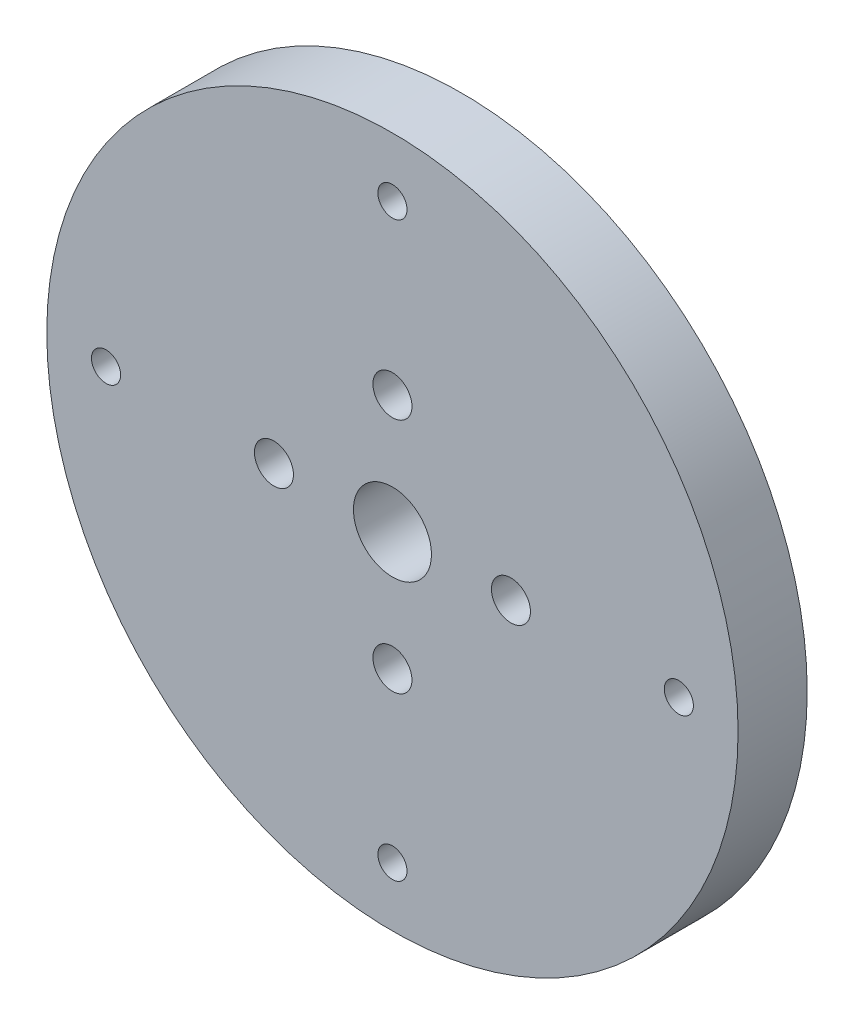
ISO-10303-21;
HEADER;
FILE_DESCRIPTION(('STEP AP214'),'2;1');
FILE_NAME('part.step','',(''),(''),'','','');
FILE_SCHEMA(('AUTOMOTIVE_DESIGN { 1 0 10303 214 1 1 1 1 }'));
ENDSEC;
DATA;
#1=APPLICATION_CONTEXT('core data for automotive mechanical design processes');
#2=APPLICATION_PROTOCOL_DEFINITION('international standard','automotive_design',2000,#1);
#3=PRODUCT_CONTEXT('',#1,'mechanical');
#4=PRODUCT('Part','Part','',(#3));
#5=PRODUCT_RELATED_PRODUCT_CATEGORY('part','',(#4));
#6=PRODUCT_DEFINITION_FORMATION('','',#4);
#7=PRODUCT_DEFINITION_CONTEXT('part definition',#1,'design');
#8=PRODUCT_DEFINITION('design','',#6,#7);
#9=PRODUCT_DEFINITION_SHAPE('','',#8);
#10=(LENGTH_UNIT() NAMED_UNIT(*) SI_UNIT(.MILLI.,.METRE.));
#11=(NAMED_UNIT(*) PLANE_ANGLE_UNIT() SI_UNIT($,.RADIAN.));
#12=(NAMED_UNIT(*) SI_UNIT($,.STERADIAN.) SOLID_ANGLE_UNIT());
#13=UNCERTAINTY_MEASURE_WITH_UNIT(LENGTH_MEASURE(1.E-05),#10,'distance_accuracy_value','');
#14=(GEOMETRIC_REPRESENTATION_CONTEXT(3) GLOBAL_UNCERTAINTY_ASSIGNED_CONTEXT((#13)) GLOBAL_UNIT_ASSIGNED_CONTEXT((#10,
#11,#12)) REPRESENTATION_CONTEXT('',''));
#15=CARTESIAN_POINT('',(0.,0.,0.));
#16=DIRECTION('',(0.,0.,1.));
#17=DIRECTION('',(1.,0.,0.));
#18=AXIS2_PLACEMENT_3D('',#15,#16,#17);
#19=CARTESIAN_POINT('',(29.0000000000008,8.18902359905425E-13,7.));
#20=DIRECTION('',(0.,0.,-1.));
#21=DIRECTION('',(-1.,0.,0.));
#22=AXIS2_PLACEMENT_3D('',#19,#20,#21);
#23=CYLINDRICAL_SURFACE('',#22,1.47500000000064);
#24=CARTESIAN_POINT('',(29.0000000000008,8.18902359905425E-13,7.));
#25=DIRECTION('',(0.,0.,1.));
#26=DIRECTION('',(1.,0.,0.));
#27=AXIS2_PLACEMENT_3D('',#24,#25,#26);
#28=CIRCLE('',#27,1.47500000000064);
#29=CARTESIAN_POINT('',(30.4750000000015,8.18902359905425E-13,7.));
#30=VERTEX_POINT('',#29);
#31=EDGE_CURVE('E40',#30,#30,#28,.T.);
#32=ORIENTED_EDGE('',*,*,#31,.T.);
#33=EDGE_LOOP('',(#32));
#34=FACE_BOUND('',#33,.T.);
#35=CARTESIAN_POINT('',(29.0000000000008,8.18902359905425E-13,0.));
#36=DIRECTION('',(0.,0.,1.));
#37=DIRECTION('',(1.,0.,0.));
#38=AXIS2_PLACEMENT_3D('',#35,#36,#37);
#39=CIRCLE('',#38,1.47500000000064);
#40=CARTESIAN_POINT('',(30.4750000000015,8.18902359905425E-13,0.));
#41=VERTEX_POINT('',#40);
#42=EDGE_CURVE('E72',#41,#41,#39,.T.);
#43=ORIENTED_EDGE('',*,*,#42,.F.);
#44=EDGE_LOOP('',(#43));
#45=FACE_BOUND('',#44,.T.);
#46=ADVANCED_FACE('F32',(#34,#45),#23,.F.);
#47=CARTESIAN_POINT('',(1.63780471981085E-12,-29.,7.));
#48=DIRECTION('',(0.,0.,-1.));
#49=DIRECTION('',(-1.,0.,0.));
#50=AXIS2_PLACEMENT_3D('',#47,#48,#49);
#51=CYLINDRICAL_SURFACE('',#50,1.47500000000176);
#52=CARTESIAN_POINT('',(1.63780471981085E-12,-29.,7.));
#53=DIRECTION('',(0.,0.,1.));
#54=DIRECTION('',(1.,0.,0.));
#55=AXIS2_PLACEMENT_3D('',#52,#53,#54);
#56=CIRCLE('',#55,1.47500000000176);
#57=CARTESIAN_POINT('',(1.4750000000034,-29.,7.));
#58=VERTEX_POINT('',#57);
#59=EDGE_CURVE('E45',#58,#58,#56,.T.);
#60=ORIENTED_EDGE('',*,*,#59,.T.);
#61=EDGE_LOOP('',(#60));
#62=FACE_BOUND('',#61,.T.);
#63=CARTESIAN_POINT('',(1.63780471981085E-12,-29.,0.));
#64=DIRECTION('',(0.,0.,1.));
#65=DIRECTION('',(1.,0.,0.));
#66=AXIS2_PLACEMENT_3D('',#63,#64,#65);
#67=CIRCLE('',#66,1.47500000000176);
#68=CARTESIAN_POINT('',(1.4750000000034,-29.,0.));
#69=VERTEX_POINT('',#68);
#70=EDGE_CURVE('E70',#69,#69,#67,.T.);
#71=ORIENTED_EDGE('',*,*,#70,.F.);
#72=EDGE_LOOP('',(#71));
#73=FACE_BOUND('',#72,.T.);
#74=ADVANCED_FACE('F105',(#62,#73),#51,.F.);
#75=CARTESIAN_POINT('',(-28.9999999999992,-8.22453835622952E-13,7.));
#76=DIRECTION('',(0.,0.,-1.));
#77=DIRECTION('',(-1.,0.,0.));
#78=AXIS2_PLACEMENT_3D('',#75,#76,#77);
#79=CYLINDRICAL_SURFACE('',#78,1.47500000000132);
#80=CARTESIAN_POINT('',(-28.9999999999992,-8.22453835622952E-13,7.));
#81=DIRECTION('',(0.,0.,1.));
#82=DIRECTION('',(1.,0.,0.));
#83=AXIS2_PLACEMENT_3D('',#80,#81,#82);
#84=CIRCLE('',#83,1.47500000000132);
#85=CARTESIAN_POINT('',(-27.5249999999979,-8.22453835622952E-13,7.));
#86=VERTEX_POINT('',#85);
#87=EDGE_CURVE('E100',#86,#86,#84,.T.);
#88=ORIENTED_EDGE('',*,*,#87,.T.);
#89=EDGE_LOOP('',(#88));
#90=FACE_BOUND('',#89,.T.);
#91=CARTESIAN_POINT('',(-28.9999999999992,-8.22453835622952E-13,0.));
#92=DIRECTION('',(0.,0.,1.));
#93=DIRECTION('',(1.,0.,0.));
#94=AXIS2_PLACEMENT_3D('',#91,#92,#93);
#95=CIRCLE('',#94,1.47500000000132);
#96=CARTESIAN_POINT('',(-27.5249999999979,-8.22453835622952E-13,0.));
#97=VERTEX_POINT('',#96);
#98=EDGE_CURVE('E67',#97,#97,#95,.T.);
#99=ORIENTED_EDGE('',*,*,#98,.F.);
#100=EDGE_LOOP('',(#99));
#101=FACE_BOUND('',#100,.T.);
#102=ADVANCED_FACE('F124',(#90,#101),#79,.F.);
#103=CARTESIAN_POINT('',(12.0000000000011,1.1488748676929E-12,7.));
#104=DIRECTION('',(0.,0.,-1.));
#105=DIRECTION('',(-1.,0.,0.));
#106=AXIS2_PLACEMENT_3D('',#103,#104,#105);
#107=CYLINDRICAL_SURFACE('',#106,1.9750000000008);
#108=CARTESIAN_POINT('',(12.0000000000011,1.1488748676929E-12,7.));
#109=DIRECTION('',(0.,0.,1.));
#110=DIRECTION('',(1.,0.,0.));
#111=AXIS2_PLACEMENT_3D('',#108,#109,#110);
#112=CIRCLE('',#111,1.9750000000008);
#113=CARTESIAN_POINT('',(13.975000000002,1.1488748676929E-12,7.));
#114=VERTEX_POINT('',#113);
#115=EDGE_CURVE('E97',#114,#114,#112,.T.);
#116=ORIENTED_EDGE('',*,*,#115,.T.);
#117=EDGE_LOOP('',(#116));
#118=FACE_BOUND('',#117,.T.);
#119=CARTESIAN_POINT('',(12.0000000000011,1.1488748676929E-12,0.));
#120=DIRECTION('',(0.,0.,1.));
#121=DIRECTION('',(1.,0.,0.));
#122=AXIS2_PLACEMENT_3D('',#119,#120,#121);
#123=CIRCLE('',#122,1.9750000000008);
#124=CARTESIAN_POINT('',(13.975000000002,1.1488748676929E-12,0.));
#125=VERTEX_POINT('',#124);
#126=EDGE_CURVE('E64',#125,#125,#123,.T.);
#127=ORIENTED_EDGE('',*,*,#126,.F.);
#128=EDGE_LOOP('',(#127));
#129=FACE_BOUND('',#128,.T.);
#130=ADVANCED_FACE('F131',(#118,#129),#107,.F.);
#131=CARTESIAN_POINT('',(2.29774973538579E-12,-12.,7.));
#132=DIRECTION('',(0.,0.,-1.));
#133=DIRECTION('',(-1.,0.,0.));
#134=AXIS2_PLACEMENT_3D('',#131,#132,#133);
#135=CYLINDRICAL_SURFACE('',#134,1.97500000000228);
#136=CARTESIAN_POINT('',(2.29774973538579E-12,-12.,7.));
#137=DIRECTION('',(0.,0.,1.));
#138=DIRECTION('',(1.,0.,0.));
#139=AXIS2_PLACEMENT_3D('',#136,#137,#138);
#140=CIRCLE('',#139,1.97500000000228);
#141=CARTESIAN_POINT('',(1.97500000000458,-12.,7.));
#142=VERTEX_POINT('',#141);
#143=EDGE_CURVE('E94',#142,#142,#140,.T.);
#144=ORIENTED_EDGE('',*,*,#143,.T.);
#145=EDGE_LOOP('',(#144));
#146=FACE_BOUND('',#145,.T.);
#147=CARTESIAN_POINT('',(2.29774973538579E-12,-12.,0.));
#148=DIRECTION('',(0.,0.,1.));
#149=DIRECTION('',(1.,0.,0.));
#150=AXIS2_PLACEMENT_3D('',#147,#148,#149);
#151=CIRCLE('',#150,1.97500000000228);
#152=CARTESIAN_POINT('',(1.97500000000458,-12.,0.));
#153=VERTEX_POINT('',#152);
#154=EDGE_CURVE('E61',#153,#153,#151,.T.);
#155=ORIENTED_EDGE('',*,*,#154,.F.);
#156=EDGE_LOOP('',(#155));
#157=FACE_BOUND('',#156,.T.);
#158=ADVANCED_FACE('F135',(#146,#157),#135,.F.);
#159=CARTESIAN_POINT('',(-11.9999999999989,-1.15034444385187E-12,7.));
#160=DIRECTION('',(0.,0.,-1.));
#161=DIRECTION('',(-1.,0.,0.));
#162=AXIS2_PLACEMENT_3D('',#159,#160,#161);
#163=CYLINDRICAL_SURFACE('',#162,1.97500000000156);
#164=CARTESIAN_POINT('',(-11.9999999999989,-1.15034444385187E-12,7.));
#165=DIRECTION('',(0.,0.,1.));
#166=DIRECTION('',(1.,0.,0.));
#167=AXIS2_PLACEMENT_3D('',#164,#165,#166);
#168=CIRCLE('',#167,1.97500000000156);
#169=CARTESIAN_POINT('',(-10.0249999999973,-1.15034444385187E-12,7.));
#170=VERTEX_POINT('',#169);
#171=EDGE_CURVE('E91',#170,#170,#168,.T.);
#172=ORIENTED_EDGE('',*,*,#171,.T.);
#173=EDGE_LOOP('',(#172));
#174=FACE_BOUND('',#173,.T.);
#175=CARTESIAN_POINT('',(-11.9999999999989,-1.15034444385187E-12,0.));
#176=DIRECTION('',(0.,0.,1.));
#177=DIRECTION('',(1.,0.,0.));
#178=AXIS2_PLACEMENT_3D('',#175,#176,#177);
#179=CIRCLE('',#178,1.97500000000156);
#180=CARTESIAN_POINT('',(-10.0249999999973,-1.15034444385187E-12,0.));
#181=VERTEX_POINT('',#180);
#182=EDGE_CURVE('E58',#181,#181,#179,.T.);
#183=ORIENTED_EDGE('',*,*,#182,.F.);
#184=EDGE_LOOP('',(#183));
#185=FACE_BOUND('',#184,.T.);
#186=ADVANCED_FACE('F139',(#174,#185),#163,.F.);
#187=CARTESIAN_POINT('',(0.,0.,7.));
#188=DIRECTION('',(0.,0.,-1.));
#189=DIRECTION('',(-1.,0.,0.));
#190=AXIS2_PLACEMENT_3D('',#187,#188,#189);
#191=CYLINDRICAL_SURFACE('',#190,35.);
#192=CARTESIAN_POINT('',(0.,0.,7.));
#193=DIRECTION('',(0.,0.,1.));
#194=DIRECTION('',(1.,0.,0.));
#195=AXIS2_PLACEMENT_3D('',#192,#193,#194);
#196=CIRCLE('',#195,35.);
#197=CARTESIAN_POINT('',(35.,0.,7.));
#198=VERTEX_POINT('',#197);
#199=EDGE_CURVE('E86',#198,#198,#196,.T.);
#200=ORIENTED_EDGE('',*,*,#199,.F.);
#201=EDGE_LOOP('',(#200));
#202=FACE_BOUND('',#201,.T.);
#203=CARTESIAN_POINT('',(0.,0.,0.));
#204=DIRECTION('',(0.,0.,1.));
#205=DIRECTION('',(1.,0.,0.));
#206=AXIS2_PLACEMENT_3D('',#203,#204,#205);
#207=CIRCLE('',#206,35.);
#208=CARTESIAN_POINT('',(35.,0.,0.));
#209=VERTEX_POINT('',#208);
#210=EDGE_CURVE('E55',#209,#209,#207,.T.);
#211=ORIENTED_EDGE('',*,*,#210,.T.);
#212=EDGE_LOOP('',(#211));
#213=FACE_BOUND('',#212,.T.);
#214=ADVANCED_FACE('F143',(#202,#213),#191,.T.);
#215=CARTESIAN_POINT('',(0.,29.,7.));
#216=DIRECTION('',(0.,0.,-1.));
#217=DIRECTION('',(-1.,0.,0.));
#218=AXIS2_PLACEMENT_3D('',#215,#216,#217);
#219=CYLINDRICAL_SURFACE('',#218,1.475);
#220=CARTESIAN_POINT('',(0.,29.,7.));
#221=DIRECTION('',(0.,0.,1.));
#222=DIRECTION('',(1.,0.,0.));
#223=AXIS2_PLACEMENT_3D('',#220,#221,#222);
#224=CIRCLE('',#223,1.475);
#225=CARTESIAN_POINT('',(1.475,29.,7.));
#226=VERTEX_POINT('',#225);
#227=EDGE_CURVE('E81',#226,#226,#224,.T.);
#228=ORIENTED_EDGE('',*,*,#227,.T.);
#229=EDGE_LOOP('',(#228));
#230=FACE_BOUND('',#229,.T.);
#231=CARTESIAN_POINT('',(0.,29.,0.));
#232=DIRECTION('',(0.,0.,1.));
#233=DIRECTION('',(1.,0.,0.));
#234=AXIS2_PLACEMENT_3D('',#231,#232,#233);
#235=CIRCLE('',#234,1.475);
#236=CARTESIAN_POINT('',(1.475,29.,0.));
#237=VERTEX_POINT('',#236);
#238=EDGE_CURVE('E52',#237,#237,#235,.T.);
#239=ORIENTED_EDGE('',*,*,#238,.F.);
#240=EDGE_LOOP('',(#239));
#241=FACE_BOUND('',#240,.T.);
#242=ADVANCED_FACE('F146',(#230,#241),#219,.F.);
#243=CARTESIAN_POINT('',(0.,12.,7.));
#244=DIRECTION('',(0.,0.,-1.));
#245=DIRECTION('',(-1.,0.,0.));
#246=AXIS2_PLACEMENT_3D('',#243,#244,#245);
#247=CYLINDRICAL_SURFACE('',#246,1.975);
#248=CARTESIAN_POINT('',(0.,12.,7.));
#249=DIRECTION('',(0.,0.,1.));
#250=DIRECTION('',(1.,0.,0.));
#251=AXIS2_PLACEMENT_3D('',#248,#249,#250);
#252=CIRCLE('',#251,1.975);
#253=CARTESIAN_POINT('',(1.975,12.,7.));
#254=VERTEX_POINT('',#253);
#255=EDGE_CURVE('E77',#254,#254,#252,.T.);
#256=ORIENTED_EDGE('',*,*,#255,.T.);
#257=EDGE_LOOP('',(#256));
#258=FACE_BOUND('',#257,.T.);
#259=CARTESIAN_POINT('',(0.,12.,0.));
#260=DIRECTION('',(0.,0.,1.));
#261=DIRECTION('',(1.,0.,0.));
#262=AXIS2_PLACEMENT_3D('',#259,#260,#261);
#263=CIRCLE('',#262,1.975);
#264=CARTESIAN_POINT('',(1.975,12.,0.));
#265=VERTEX_POINT('',#264);
#266=EDGE_CURVE('E49',#265,#265,#263,.T.);
#267=ORIENTED_EDGE('',*,*,#266,.F.);
#268=EDGE_LOOP('',(#267));
#269=FACE_BOUND('',#268,.T.);
#270=ADVANCED_FACE('F34',(#258,#269),#247,.F.);
#271=CARTESIAN_POINT('',(0.,0.,7.));
#272=DIRECTION('',(0.,0.,-1.));
#273=DIRECTION('',(-1.,0.,0.));
#274=AXIS2_PLACEMENT_3D('',#271,#272,#273);
#275=CYLINDRICAL_SURFACE('',#274,3.95);
#276=CARTESIAN_POINT('',(0.,0.,7.));
#277=DIRECTION('',(0.,0.,1.));
#278=DIRECTION('',(1.,0.,0.));
#279=AXIS2_PLACEMENT_3D('',#276,#277,#278);
#280=CIRCLE('',#279,3.95);
#281=CARTESIAN_POINT('',(3.95,0.,7.));
#282=VERTEX_POINT('',#281);
#283=EDGE_CURVE('E10',#282,#282,#280,.T.);
#284=ORIENTED_EDGE('',*,*,#283,.T.);
#285=EDGE_LOOP('',(#284));
#286=FACE_BOUND('',#285,.T.);
#287=CARTESIAN_POINT('',(0.,0.,0.));
#288=DIRECTION('',(0.,0.,1.));
#289=DIRECTION('',(1.,0.,0.));
#290=AXIS2_PLACEMENT_3D('',#287,#288,#289);
#291=CIRCLE('',#290,3.95);
#292=CARTESIAN_POINT('',(3.95,0.,0.));
#293=VERTEX_POINT('',#292);
#294=EDGE_CURVE('E36',#293,#293,#291,.T.);
#295=ORIENTED_EDGE('',*,*,#294,.F.);
#296=EDGE_LOOP('',(#295));
#297=FACE_BOUND('',#296,.T.);
#298=ADVANCED_FACE('F112',(#286,#297),#275,.F.);
#299=CARTESIAN_POINT('',(0.,0.,7.));
#300=DIRECTION('',(0.,0.,1.));
#301=DIRECTION('',(1.,0.,0.));
#302=AXIS2_PLACEMENT_3D('',#299,#300,#301);
#303=PLANE('',#302);
#304=ORIENTED_EDGE('',*,*,#255,.F.);
#305=EDGE_LOOP('',(#304));
#306=FACE_BOUND('',#305,.T.);
#307=ORIENTED_EDGE('',*,*,#227,.F.);
#308=EDGE_LOOP('',(#307));
#309=FACE_BOUND('',#308,.T.);
#310=ORIENTED_EDGE('',*,*,#199,.T.);
#311=EDGE_LOOP('',(#310));
#312=FACE_BOUND('',#311,.T.);
#313=ORIENTED_EDGE('',*,*,#171,.F.);
#314=EDGE_LOOP('',(#313));
#315=FACE_BOUND('',#314,.T.);
#316=ORIENTED_EDGE('',*,*,#143,.F.);
#317=EDGE_LOOP('',(#316));
#318=FACE_BOUND('',#317,.T.);
#319=ORIENTED_EDGE('',*,*,#115,.F.);
#320=EDGE_LOOP('',(#319));
#321=FACE_BOUND('',#320,.T.);
#322=ORIENTED_EDGE('',*,*,#87,.F.);
#323=EDGE_LOOP('',(#322));
#324=FACE_BOUND('',#323,.T.);
#325=ORIENTED_EDGE('',*,*,#59,.F.);
#326=EDGE_LOOP('',(#325));
#327=FACE_BOUND('',#326,.T.);
#328=ORIENTED_EDGE('',*,*,#31,.F.);
#329=EDGE_LOOP('',(#328));
#330=FACE_BOUND('',#329,.T.);
#331=ORIENTED_EDGE('',*,*,#283,.F.);
#332=EDGE_LOOP('',(#331));
#333=FACE_BOUND('',#332,.T.);
#334=ADVANCED_FACE('F108',(#306,#309,#312,#315,#318,#321,#324,#327,#330,#333),#303,.T.);
#335=CARTESIAN_POINT('',(0.,0.,0.));
#336=DIRECTION('',(0.,0.,1.));
#337=DIRECTION('',(1.,0.,0.));
#338=AXIS2_PLACEMENT_3D('',#335,#336,#337);
#339=PLANE('',#338);
#340=ORIENTED_EDGE('',*,*,#266,.T.);
#341=EDGE_LOOP('',(#340));
#342=FACE_BOUND('',#341,.T.);
#343=ORIENTED_EDGE('',*,*,#238,.T.);
#344=EDGE_LOOP('',(#343));
#345=FACE_BOUND('',#344,.T.);
#346=ORIENTED_EDGE('',*,*,#210,.F.);
#347=EDGE_LOOP('',(#346));
#348=FACE_BOUND('',#347,.T.);
#349=ORIENTED_EDGE('',*,*,#182,.T.);
#350=EDGE_LOOP('',(#349));
#351=FACE_BOUND('',#350,.T.);
#352=ORIENTED_EDGE('',*,*,#154,.T.);
#353=EDGE_LOOP('',(#352));
#354=FACE_BOUND('',#353,.T.);
#355=ORIENTED_EDGE('',*,*,#126,.T.);
#356=EDGE_LOOP('',(#355));
#357=FACE_BOUND('',#356,.T.);
#358=ORIENTED_EDGE('',*,*,#98,.T.);
#359=EDGE_LOOP('',(#358));
#360=FACE_BOUND('',#359,.T.);
#361=ORIENTED_EDGE('',*,*,#70,.T.);
#362=EDGE_LOOP('',(#361));
#363=FACE_BOUND('',#362,.T.);
#364=ORIENTED_EDGE('',*,*,#42,.T.);
#365=EDGE_LOOP('',(#364));
#366=FACE_BOUND('',#365,.T.);
#367=ORIENTED_EDGE('',*,*,#294,.T.);
#368=EDGE_LOOP('',(#367));
#369=FACE_BOUND('',#368,.T.);
#370=ADVANCED_FACE('F111',(#342,#345,#348,#351,#354,#357,#360,#363,#366,#369),#339,.F.);
#371=CLOSED_SHELL('',(#46,#74,#102,#130,#158,#186,#214,#242,#270,#298,#334,#370));
#372=MANIFOLD_SOLID_BREP('B2',#371);
#373=ADVANCED_BREP_SHAPE_REPRESENTATION('',(#18,#372),#14);
#374=SHAPE_DEFINITION_REPRESENTATION(#9,#373);
ENDSEC;
END-ISO-10303-21;
